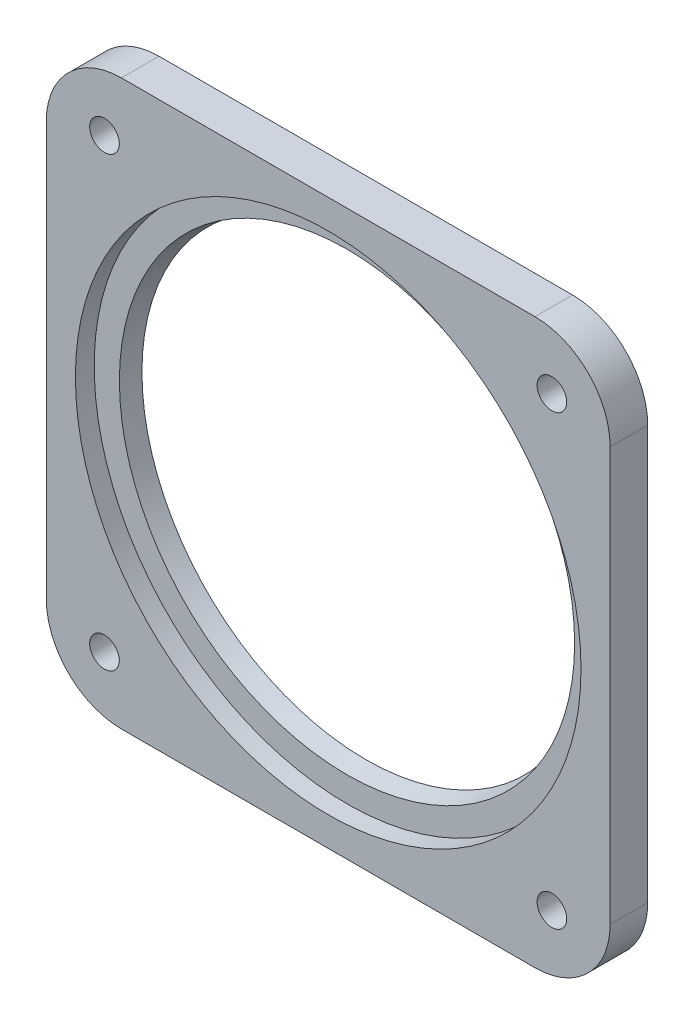
ISO-10303-21;
HEADER;
FILE_DESCRIPTION(('STEP AP214'),'2;1');
FILE_NAME('part.step','',(''),(''),'','','');
FILE_SCHEMA(('AUTOMOTIVE_DESIGN { 1 0 10303 214 1 1 1 1 }'));
ENDSEC;
DATA;
#1=APPLICATION_CONTEXT('core data for automotive mechanical design processes');
#2=APPLICATION_PROTOCOL_DEFINITION('international standard','automotive_design',2000,#1);
#3=PRODUCT_CONTEXT('',#1,'mechanical');
#4=PRODUCT('Part','Part','',(#3));
#5=PRODUCT_RELATED_PRODUCT_CATEGORY('part','',(#4));
#6=PRODUCT_DEFINITION_FORMATION('','',#4);
#7=PRODUCT_DEFINITION_CONTEXT('part definition',#1,'design');
#8=PRODUCT_DEFINITION('design','',#6,#7);
#9=PRODUCT_DEFINITION_SHAPE('','',#8);
#10=(LENGTH_UNIT() NAMED_UNIT(*) SI_UNIT(.MILLI.,.METRE.));
#11=(NAMED_UNIT(*) PLANE_ANGLE_UNIT() SI_UNIT($,.RADIAN.));
#12=(NAMED_UNIT(*) SI_UNIT($,.STERADIAN.) SOLID_ANGLE_UNIT());
#13=UNCERTAINTY_MEASURE_WITH_UNIT(LENGTH_MEASURE(1.E-05),#10,'distance_accuracy_value','');
#14=(GEOMETRIC_REPRESENTATION_CONTEXT(3) GLOBAL_UNCERTAINTY_ASSIGNED_CONTEXT((#13)) GLOBAL_UNIT_ASSIGNED_CONTEXT((#10,
#11,#12)) REPRESENTATION_CONTEXT('',''));
#15=CARTESIAN_POINT('',(0.,0.,0.));
#16=DIRECTION('',(0.,0.,1.));
#17=DIRECTION('',(1.,0.,0.));
#18=AXIS2_PLACEMENT_3D('',#15,#16,#17);
#19=CARTESIAN_POINT('',(-75.6285,0.,0.));
#20=DIRECTION('',(0.,0.,-1.));
#21=DIRECTION('',(-1.,0.,0.));
#22=AXIS2_PLACEMENT_3D('',#19,#20,#21);
#23=PLANE('',#22);
#24=CARTESIAN_POINT('',(0.,0.,0.));
#25=DIRECTION('',(0.,0.,-1.));
#26=DIRECTION('',(-1.,0.,0.));
#27=AXIS2_PLACEMENT_3D('',#24,#25,#26);
#28=CIRCLE('',#27,76.8985);
#29=CARTESIAN_POINT('',(-76.8985,0.,0.));
#30=VERTEX_POINT('',#29);
#31=EDGE_CURVE('E11',#30,#30,#28,.T.);
#32=ORIENTED_EDGE('',*,*,#31,.T.);
#33=EDGE_LOOP('',(#32));
#34=FACE_BOUND('',#33,.T.);
#35=CARTESIAN_POINT('',(0.,0.,0.));
#36=DIRECTION('',(0.,0.,-1.));
#37=DIRECTION('',(-1.,0.,0.));
#38=AXIS2_PLACEMENT_3D('',#35,#36,#37);
#39=CIRCLE('',#38,75.6285);
#40=CARTESIAN_POINT('',(-75.6285,0.,0.));
#41=VERTEX_POINT('',#40);
#42=EDGE_CURVE('E62',#41,#41,#39,.T.);
#43=ORIENTED_EDGE('',*,*,#42,.F.);
#44=EDGE_LOOP('',(#43));
#45=FACE_BOUND('',#44,.T.);
#46=ADVANCED_FACE('F52',(#34,#45),#23,.T.);
#47=CARTESIAN_POINT('',(0.,0.,-10.9982186410887));
#48=DIRECTION('',(0.,0.,-1.));
#49=DIRECTION('',(-1.,0.,0.));
#50=AXIS2_PLACEMENT_3D('',#47,#48,#49);
#51=CYLINDRICAL_SURFACE('',#50,76.8985);
#52=CARTESIAN_POINT('',(0.,0.,6.35000000000001));
#53=DIRECTION('',(0.,0.,-1.));
#54=DIRECTION('',(-1.,0.,0.));
#55=AXIS2_PLACEMENT_3D('',#52,#53,#54);
#56=CIRCLE('',#55,76.8985);
#57=CARTESIAN_POINT('',(-76.8985,0.,6.35000000000001));
#58=VERTEX_POINT('',#57);
#59=EDGE_CURVE('E58',#58,#58,#56,.T.);
#60=ORIENTED_EDGE('',*,*,#59,.T.);
#61=EDGE_LOOP('',(#60));
#62=FACE_BOUND('',#61,.T.);
#63=ORIENTED_EDGE('',*,*,#31,.F.);
#64=EDGE_LOOP('',(#63));
#65=FACE_BOUND('',#64,.T.);
#66=ADVANCED_FACE('F73',(#62,#65),#51,.T.);
#67=CARTESIAN_POINT('',(0.,0.,6.35000000000001));
#68=DIRECTION('',(0.,0.,1.));
#69=DIRECTION('',(1.,0.,0.));
#70=AXIS2_PLACEMENT_3D('',#67,#68,#69);
#71=CONICAL_SURFACE('',#70,76.8985,0.197395559849879);
#72=ORIENTED_EDGE('',*,*,#42,.T.);
#73=EDGE_LOOP('',(#72));
#74=FACE_BOUND('',#73,.T.);
#75=ORIENTED_EDGE('',*,*,#59,.F.);
#76=EDGE_LOOP('',(#75));
#77=FACE_BOUND('',#76,.T.);
#78=ADVANCED_FACE('F69',(#74,#77),#71,.F.);
#79=CLOSED_SHELL('',(#46,#66,#78));
#80=MANIFOLD_SOLID_BREP('B2',#79);
#81=CARTESIAN_POINT('',(0.,0.,12.7));
#82=DIRECTION('',(0.,0.,-1.));
#83=DIRECTION('',(-1.,0.,0.));
#84=AXIS2_PLACEMENT_3D('',#81,#82,#83);
#85=CYLINDRICAL_SURFACE('',#84,76.8985);
#86=CARTESIAN_POINT('',(0.,0.,0.));
#87=DIRECTION('',(0.,0.,1.));
#88=DIRECTION('',(1.,0.,0.));
#89=AXIS2_PLACEMENT_3D('',#86,#87,#88);
#90=CIRCLE('',#89,76.8985);
#91=CARTESIAN_POINT('',(76.8985,0.,0.));
#92=VERTEX_POINT('',#91);
#93=EDGE_CURVE('E214',#92,#92,#90,.T.);
#94=ORIENTED_EDGE('',*,*,#93,.F.);
#95=EDGE_LOOP('',(#94));
#96=FACE_BOUND('',#95,.T.);
#97=CARTESIAN_POINT('',(0.,0.,6.35));
#98=DIRECTION('',(0.,0.,1.));
#99=DIRECTION('',(1.,0.,0.));
#100=AXIS2_PLACEMENT_3D('',#97,#98,#99);
#101=CIRCLE('',#100,76.8985);
#102=CARTESIAN_POINT('',(76.8985,0.,6.35));
#103=VERTEX_POINT('',#102);
#104=EDGE_CURVE('E249',#103,#103,#101,.T.);
#105=ORIENTED_EDGE('',*,*,#104,.T.);
#106=EDGE_LOOP('',(#105));
#107=FACE_BOUND('',#106,.T.);
#108=ADVANCED_FACE('F105',(#96,#107),#85,.F.);
#109=CARTESIAN_POINT('',(-69.8499999999999,-69.8500000000001,12.7));
#110=DIRECTION('',(0.,0.,-1.));
#111=DIRECTION('',(-1.,0.,0.));
#112=AXIS2_PLACEMENT_3D('',#109,#110,#111);
#113=PLANE('',#112);
#114=CARTESIAN_POINT('',(75.5831095881406,75.5831095881405,12.7));
#115=DIRECTION('',(0.,0.,-1.));
#116=DIRECTION('',(-1.,0.,0.));
#117=AXIS2_PLACEMENT_3D('',#114,#115,#116);
#118=CIRCLE('',#117,5.);
#119=CARTESIAN_POINT('',(70.5831095881406,75.5831095881405,12.7));
#120=VERTEX_POINT('',#119);
#121=EDGE_CURVE('E631',#120,#120,#118,.T.);
#122=ORIENTED_EDGE('',*,*,#121,.T.);
#123=EDGE_LOOP('',(#122));
#124=FACE_BOUND('',#123,.T.);
#125=CARTESIAN_POINT('',(-75.5831095881406,75.5831095881405,12.7));
#126=DIRECTION('',(0.,0.,-1.));
#127=DIRECTION('',(-1.,0.,0.));
#128=AXIS2_PLACEMENT_3D('',#125,#126,#127);
#129=CIRCLE('',#128,5.);
#130=CARTESIAN_POINT('',(-80.5831095881406,75.5831095881405,12.7));
#131=VERTEX_POINT('',#130);
#132=EDGE_CURVE('E645',#131,#131,#129,.T.);
#133=ORIENTED_EDGE('',*,*,#132,.T.);
#134=EDGE_LOOP('',(#133));
#135=FACE_BOUND('',#134,.T.);
#136=CARTESIAN_POINT('',(75.5831095881406,-75.5831095881407,12.7));
#137=DIRECTION('',(0.,0.,-1.));
#138=DIRECTION('',(-1.,0.,0.));
#139=AXIS2_PLACEMENT_3D('',#136,#137,#138);
#140=CIRCLE('',#139,5.);
#141=CARTESIAN_POINT('',(70.5831095881406,-75.5831095881407,12.7));
#142=VERTEX_POINT('',#141);
#143=EDGE_CURVE('E347',#142,#142,#140,.T.);
#144=ORIENTED_EDGE('',*,*,#143,.T.);
#145=EDGE_LOOP('',(#144));
#146=FACE_BOUND('',#145,.T.);
#147=CARTESIAN_POINT('',(-75.5831095881405,-75.5831095881407,12.7));
#148=DIRECTION('',(0.,0.,-1.));
#149=DIRECTION('',(-1.,0.,0.));
#150=AXIS2_PLACEMENT_3D('',#147,#148,#149);
#151=CIRCLE('',#150,5.);
#152=CARTESIAN_POINT('',(-80.5831095881405,-75.5831095881407,12.7));
#153=VERTEX_POINT('',#152);
#154=EDGE_CURVE('E259',#153,#153,#151,.T.);
#155=ORIENTED_EDGE('',*,*,#154,.T.);
#156=EDGE_LOOP('',(#155));
#157=FACE_BOUND('',#156,.T.);
#158=CARTESIAN_POINT('',(0.,0.,12.7));
#159=DIRECTION('',(0.,0.,-1.));
#160=DIRECTION('',(-1.,0.,0.));
#161=AXIS2_PLACEMENT_3D('',#158,#159,#160);
#162=CIRCLE('',#161,85.4075);
#163=CARTESIAN_POINT('',(-85.4075,0.,12.7));
#164=VERTEX_POINT('',#163);
#165=EDGE_CURVE('E109',#164,#164,#162,.T.);
#166=ORIENTED_EDGE('',*,*,#165,.T.);
#167=EDGE_LOOP('',(#166));
#168=FACE_BOUND('',#167,.T.);
#169=CARTESIAN_POINT('',(-69.8499999999999,-69.8500000000001,12.7));
#170=DIRECTION('',(0.,0.,1.));
#171=DIRECTION('',(-1.,0.,0.));
#172=AXIS2_PLACEMENT_3D('',#169,#170,#171);
#173=CIRCLE('',#172,25.4);
#174=CARTESIAN_POINT('',(-95.2499999999999,-69.8500000000001,12.7));
#175=VERTEX_POINT('',#174);
#176=CARTESIAN_POINT('',(-69.8499999999999,-95.2500000000001,12.7));
#177=VERTEX_POINT('',#176);
#178=EDGE_CURVE('E232',#175,#177,#173,.T.);
#179=ORIENTED_EDGE('',*,*,#178,.T.);
#180=DIRECTION('',(1.,0.,0.));
#181=VECTOR('',#180,1.);
#182=CARTESIAN_POINT('',(69.8499999999999,-95.2500000000001,12.7));
#183=LINE('',#182,#181);
#184=CARTESIAN_POINT('',(69.8499999999999,-95.2500000000001,12.7));
#185=VERTEX_POINT('',#184);
#186=EDGE_CURVE('E168',#177,#185,#183,.T.);
#187=ORIENTED_EDGE('',*,*,#186,.T.);
#188=CARTESIAN_POINT('',(69.8499999999999,-69.8500000000001,12.7));
#189=DIRECTION('',(0.,0.,1.));
#190=DIRECTION('',(-1.,0.,0.));
#191=AXIS2_PLACEMENT_3D('',#188,#189,#190);
#192=CIRCLE('',#191,25.4000000000001);
#193=CARTESIAN_POINT('',(95.25,-69.8499999999999,12.7));
#194=VERTEX_POINT('',#193);
#195=EDGE_CURVE('E276',#185,#194,#192,.T.);
#196=ORIENTED_EDGE('',*,*,#195,.T.);
#197=DIRECTION('',(0.,1.,0.));
#198=VECTOR('',#197,1.);
#199=CARTESIAN_POINT('',(95.25,69.8499999999999,12.7));
#200=LINE('',#199,#198);
#201=CARTESIAN_POINT('',(95.25,69.8499999999999,12.7));
#202=VERTEX_POINT('',#201);
#203=EDGE_CURVE('E279',#194,#202,#200,.T.);
#204=ORIENTED_EDGE('',*,*,#203,.T.);
#205=CARTESIAN_POINT('',(69.85,69.8499999999999,12.7));
#206=DIRECTION('',(0.,0.,1.));
#207=DIRECTION('',(1.,0.,0.));
#208=AXIS2_PLACEMENT_3D('',#205,#206,#207);
#209=CIRCLE('',#208,25.4);
#210=CARTESIAN_POINT('',(69.85,95.2499999999999,12.7));
#211=VERTEX_POINT('',#210);
#212=EDGE_CURVE('E187',#202,#211,#209,.T.);
#213=ORIENTED_EDGE('',*,*,#212,.T.);
#214=DIRECTION('',(-1.,0.,0.));
#215=VECTOR('',#214,1.);
#216=CARTESIAN_POINT('',(-69.85,95.2499999999999,12.7));
#217=LINE('',#216,#215);
#218=CARTESIAN_POINT('',(-69.85,95.2499999999999,12.7));
#219=VERTEX_POINT('',#218);
#220=EDGE_CURVE('E181',#211,#219,#217,.T.);
#221=ORIENTED_EDGE('',*,*,#220,.T.);
#222=CARTESIAN_POINT('',(-69.85,69.8499999999999,12.7));
#223=DIRECTION('',(0.,0.,1.));
#224=DIRECTION('',(-1.,0.,0.));
#225=AXIS2_PLACEMENT_3D('',#222,#223,#224);
#226=CIRCLE('',#225,25.4);
#227=CARTESIAN_POINT('',(-95.25,69.8499999999999,12.7));
#228=VERTEX_POINT('',#227);
#229=EDGE_CURVE('E185',#219,#228,#226,.T.);
#230=ORIENTED_EDGE('',*,*,#229,.T.);
#231=DIRECTION('',(0.,-1.,0.));
#232=VECTOR('',#231,1.);
#233=CARTESIAN_POINT('',(-95.2499999999999,-69.8500000000001,12.7));
#234=LINE('',#233,#232);
#235=EDGE_CURVE('E125',#228,#175,#234,.T.);
#236=ORIENTED_EDGE('',*,*,#235,.T.);
#237=EDGE_LOOP('',(#179,#187,#196,#204,#213,#221,#230,#236));
#238=FACE_BOUND('',#237,.T.);
#239=ADVANCED_FACE('F183',(#124,#135,#146,#157,#168,#238),#113,.F.);
#240=CARTESIAN_POINT('',(-69.8499999999999,-69.8500000000001,0.));
#241=DIRECTION('',(0.,0.,-1.));
#242=DIRECTION('',(-1.,0.,0.));
#243=AXIS2_PLACEMENT_3D('',#240,#241,#242);
#244=PLANE('',#243);
#245=CARTESIAN_POINT('',(75.5831095881406,75.5831095881405,0.));
#246=DIRECTION('',(0.,0.,-1.));
#247=DIRECTION('',(-1.,0.,0.));
#248=AXIS2_PLACEMENT_3D('',#245,#246,#247);
#249=CIRCLE('',#248,9.0055);
#250=CARTESIAN_POINT('',(66.5776095881406,75.5831095881405,0.));
#251=VERTEX_POINT('',#250);
#252=EDGE_CURVE('E332',#251,#251,#249,.T.);
#253=ORIENTED_EDGE('',*,*,#252,.F.);
#254=EDGE_LOOP('',(#253));
#255=FACE_BOUND('',#254,.T.);
#256=CARTESIAN_POINT('',(-75.5831095881406,75.5831095881405,0.));
#257=DIRECTION('',(0.,0.,-1.));
#258=DIRECTION('',(-1.,0.,0.));
#259=AXIS2_PLACEMENT_3D('',#256,#257,#258);
#260=CIRCLE('',#259,9.0055);
#261=CARTESIAN_POINT('',(-84.5886095881406,75.5831095881405,0.));
#262=VERTEX_POINT('',#261);
#263=EDGE_CURVE('E336',#262,#262,#260,.T.);
#264=ORIENTED_EDGE('',*,*,#263,.F.);
#265=EDGE_LOOP('',(#264));
#266=FACE_BOUND('',#265,.T.);
#267=CARTESIAN_POINT('',(75.5831095881406,-75.5831095881407,0.));
#268=DIRECTION('',(0.,0.,-1.));
#269=DIRECTION('',(-1.,0.,0.));
#270=AXIS2_PLACEMENT_3D('',#267,#268,#269);
#271=CIRCLE('',#270,9.0055);
#272=CARTESIAN_POINT('',(66.5776095881406,-75.5831095881407,0.));
#273=VERTEX_POINT('',#272);
#274=EDGE_CURVE('E340',#273,#273,#271,.T.);
#275=ORIENTED_EDGE('',*,*,#274,.F.);
#276=EDGE_LOOP('',(#275));
#277=FACE_BOUND('',#276,.T.);
#278=CARTESIAN_POINT('',(-75.5831095881405,-75.5831095881407,0.));
#279=DIRECTION('',(0.,0.,-1.));
#280=DIRECTION('',(-1.,0.,0.));
#281=AXIS2_PLACEMENT_3D('',#278,#279,#280);
#282=CIRCLE('',#281,9.0055);
#283=CARTESIAN_POINT('',(-84.5886095881405,-75.5831095881407,0.));
#284=VERTEX_POINT('',#283);
#285=EDGE_CURVE('E343',#284,#284,#282,.T.);
#286=ORIENTED_EDGE('',*,*,#285,.F.);
#287=EDGE_LOOP('',(#286));
#288=FACE_BOUND('',#287,.T.);
#289=CARTESIAN_POINT('',(-69.8499999999999,-69.8500000000001,0.));
#290=DIRECTION('',(0.,0.,1.));
#291=DIRECTION('',(-1.,0.,0.));
#292=AXIS2_PLACEMENT_3D('',#289,#290,#291);
#293=CIRCLE('',#292,25.4);
#294=CARTESIAN_POINT('',(-95.2499999999999,-69.8500000000001,0.));
#295=VERTEX_POINT('',#294);
#296=CARTESIAN_POINT('',(-69.8499999999999,-95.2500000000001,0.));
#297=VERTEX_POINT('',#296);
#298=EDGE_CURVE('E209',#295,#297,#293,.T.);
#299=ORIENTED_EDGE('',*,*,#298,.F.);
#300=DIRECTION('',(0.,-1.,0.));
#301=VECTOR('',#300,1.);
#302=CARTESIAN_POINT('',(-95.2499999999999,-69.8500000000001,0.));
#303=LINE('',#302,#301);
#304=CARTESIAN_POINT('',(-95.25,69.8499999999999,0.));
#305=VERTEX_POINT('',#304);
#306=EDGE_CURVE('E160',#305,#295,#303,.T.);
#307=ORIENTED_EDGE('',*,*,#306,.F.);
#308=CARTESIAN_POINT('',(-69.85,69.8499999999999,0.));
#309=DIRECTION('',(0.,0.,1.));
#310=DIRECTION('',(-1.,0.,0.));
#311=AXIS2_PLACEMENT_3D('',#308,#309,#310);
#312=CIRCLE('',#311,25.4);
#313=CARTESIAN_POINT('',(-69.85,95.2499999999999,0.));
#314=VERTEX_POINT('',#313);
#315=EDGE_CURVE('E154',#314,#305,#312,.T.);
#316=ORIENTED_EDGE('',*,*,#315,.F.);
#317=DIRECTION('',(-1.,0.,0.));
#318=VECTOR('',#317,1.);
#319=CARTESIAN_POINT('',(-69.85,95.2499999999999,0.));
#320=LINE('',#319,#318);
#321=CARTESIAN_POINT('',(69.85,95.2499999999999,0.));
#322=VERTEX_POINT('',#321);
#323=EDGE_CURVE('E196',#322,#314,#320,.T.);
#324=ORIENTED_EDGE('',*,*,#323,.F.);
#325=CARTESIAN_POINT('',(69.85,69.8499999999999,0.));
#326=DIRECTION('',(0.,0.,1.));
#327=DIRECTION('',(1.,0.,0.));
#328=AXIS2_PLACEMENT_3D('',#325,#326,#327);
#329=CIRCLE('',#328,25.4);
#330=CARTESIAN_POINT('',(95.25,69.8499999999999,0.));
#331=VERTEX_POINT('',#330);
#332=EDGE_CURVE('E223',#331,#322,#329,.T.);
#333=ORIENTED_EDGE('',*,*,#332,.F.);
#334=DIRECTION('',(0.,1.,0.));
#335=VECTOR('',#334,1.);
#336=CARTESIAN_POINT('',(95.25,69.8499999999999,0.));
#337=LINE('',#336,#335);
#338=CARTESIAN_POINT('',(95.25,-69.8499999999999,0.));
#339=VERTEX_POINT('',#338);
#340=EDGE_CURVE('E220',#339,#331,#337,.T.);
#341=ORIENTED_EDGE('',*,*,#340,.F.);
#342=CARTESIAN_POINT('',(69.8499999999999,-69.8500000000001,0.));
#343=DIRECTION('',(0.,0.,1.));
#344=DIRECTION('',(-1.,0.,0.));
#345=AXIS2_PLACEMENT_3D('',#342,#343,#344);
#346=CIRCLE('',#345,25.4000000000001);
#347=CARTESIAN_POINT('',(69.8499999999999,-95.2500000000001,0.));
#348=VERTEX_POINT('',#347);
#349=EDGE_CURVE('E217',#348,#339,#346,.T.);
#350=ORIENTED_EDGE('',*,*,#349,.F.);
#351=DIRECTION('',(1.,0.,0.));
#352=VECTOR('',#351,1.);
#353=CARTESIAN_POINT('',(69.8499999999999,-95.2500000000001,0.));
#354=LINE('',#353,#352);
#355=EDGE_CURVE('E213',#297,#348,#354,.T.);
#356=ORIENTED_EDGE('',*,*,#355,.F.);
#357=EDGE_LOOP('',(#299,#307,#316,#324,#333,#341,#350,#356));
#358=FACE_BOUND('',#357,.T.);
#359=ORIENTED_EDGE('',*,*,#93,.T.);
#360=EDGE_LOOP('',(#359));
#361=FACE_BOUND('',#360,.T.);
#362=ADVANCED_FACE('F294',(#255,#266,#277,#288,#358,#361),#244,.T.);
#363=CARTESIAN_POINT('',(-69.8499999999999,-69.8500000000001,12.7));
#364=DIRECTION('',(0.,0.,-1.));
#365=DIRECTION('',(-1.,0.,0.));
#366=AXIS2_PLACEMENT_3D('',#363,#364,#365);
#367=CYLINDRICAL_SURFACE('',#366,25.4);
#368=ORIENTED_EDGE('',*,*,#298,.T.);
#369=DIRECTION('',(0.,0.,-1.));
#370=VECTOR('',#369,1.);
#371=CARTESIAN_POINT('',(-69.8499999999999,-95.2500000000001,12.7));
#372=LINE('',#371,#370);
#373=EDGE_CURVE('E50',#177,#297,#372,.T.);
#374=ORIENTED_EDGE('',*,*,#373,.F.);
#375=ORIENTED_EDGE('',*,*,#178,.F.);
#376=DIRECTION('',(0.,0.,-1.));
#377=VECTOR('',#376,1.);
#378=CARTESIAN_POINT('',(-95.2499999999999,-69.8500000000001,12.7));
#379=LINE('',#378,#377);
#380=EDGE_CURVE('E205',#175,#295,#379,.T.);
#381=ORIENTED_EDGE('',*,*,#380,.T.);
#382=EDGE_LOOP('',(#368,#374,#375,#381));
#383=FACE_BOUND('',#382,.T.);
#384=ADVANCED_FACE('F107',(#383),#367,.T.);
#385=CARTESIAN_POINT('',(69.8499999999999,-95.2500000000001,12.7));
#386=DIRECTION('',(0.,1.,0.));
#387=DIRECTION('',(0.,0.,1.));
#388=AXIS2_PLACEMENT_3D('',#385,#386,#387);
#389=PLANE('',#388);
#390=ORIENTED_EDGE('',*,*,#355,.T.);
#391=DIRECTION('',(0.,0.,-1.));
#392=VECTOR('',#391,1.);
#393=CARTESIAN_POINT('',(69.8499999999999,-95.2500000000001,12.7));
#394=LINE('',#393,#392);
#395=EDGE_CURVE('E116',#185,#348,#394,.T.);
#396=ORIENTED_EDGE('',*,*,#395,.F.);
#397=ORIENTED_EDGE('',*,*,#186,.F.);
#398=ORIENTED_EDGE('',*,*,#373,.T.);
#399=EDGE_LOOP('',(#390,#396,#397,#398));
#400=FACE_BOUND('',#399,.T.);
#401=ADVANCED_FACE('F328',(#400),#389,.F.);
#402=CARTESIAN_POINT('',(69.8499999999999,-69.8500000000001,12.7));
#403=DIRECTION('',(0.,0.,-1.));
#404=DIRECTION('',(-1.,0.,0.));
#405=AXIS2_PLACEMENT_3D('',#402,#403,#404);
#406=CYLINDRICAL_SURFACE('',#405,25.4000000000001);
#407=ORIENTED_EDGE('',*,*,#349,.T.);
#408=DIRECTION('',(0.,0.,-1.));
#409=VECTOR('',#408,1.);
#410=CARTESIAN_POINT('',(95.25,-69.8499999999999,12.7));
#411=LINE('',#410,#409);
#412=EDGE_CURVE('E243',#194,#339,#411,.T.);
#413=ORIENTED_EDGE('',*,*,#412,.F.);
#414=ORIENTED_EDGE('',*,*,#195,.F.);
#415=ORIENTED_EDGE('',*,*,#395,.T.);
#416=EDGE_LOOP('',(#407,#413,#414,#415));
#417=FACE_BOUND('',#416,.T.);
#418=ADVANCED_FACE('F563',(#417),#406,.T.);
#419=CARTESIAN_POINT('',(95.25,69.8499999999999,12.7));
#420=DIRECTION('',(-1.,0.,0.));
#421=DIRECTION('',(0.,-1.,0.));
#422=AXIS2_PLACEMENT_3D('',#419,#420,#421);
#423=PLANE('',#422);
#424=ORIENTED_EDGE('',*,*,#340,.T.);
#425=DIRECTION('',(0.,0.,-1.));
#426=VECTOR('',#425,1.);
#427=CARTESIAN_POINT('',(95.25,69.8499999999999,12.7));
#428=LINE('',#427,#426);
#429=EDGE_CURVE('E239',#202,#331,#428,.T.);
#430=ORIENTED_EDGE('',*,*,#429,.F.);
#431=ORIENTED_EDGE('',*,*,#203,.F.);
#432=ORIENTED_EDGE('',*,*,#412,.T.);
#433=EDGE_LOOP('',(#424,#430,#431,#432));
#434=FACE_BOUND('',#433,.T.);
#435=ADVANCED_FACE('F287',(#434),#423,.F.);
#436=CARTESIAN_POINT('',(69.85,69.8499999999999,12.7));
#437=DIRECTION('',(0.,0.,-1.));
#438=DIRECTION('',(-1.,0.,0.));
#439=AXIS2_PLACEMENT_3D('',#436,#437,#438);
#440=CYLINDRICAL_SURFACE('',#439,25.4);
#441=ORIENTED_EDGE('',*,*,#332,.T.);
#442=DIRECTION('',(0.,0.,-1.));
#443=VECTOR('',#442,1.);
#444=CARTESIAN_POINT('',(69.85,95.2499999999999,12.7));
#445=LINE('',#444,#443);
#446=EDGE_CURVE('E198',#211,#322,#445,.T.);
#447=ORIENTED_EDGE('',*,*,#446,.F.);
#448=ORIENTED_EDGE('',*,*,#212,.F.);
#449=ORIENTED_EDGE('',*,*,#429,.T.);
#450=EDGE_LOOP('',(#441,#447,#448,#449));
#451=FACE_BOUND('',#450,.T.);
#452=ADVANCED_FACE('F291',(#451),#440,.T.);
#453=CARTESIAN_POINT('',(-69.85,95.2499999999999,12.7));
#454=DIRECTION('',(0.,-1.,0.));
#455=DIRECTION('',(0.,0.,-1.));
#456=AXIS2_PLACEMENT_3D('',#453,#454,#455);
#457=PLANE('',#456);
#458=ORIENTED_EDGE('',*,*,#323,.T.);
#459=DIRECTION('',(0.,0.,-1.));
#460=VECTOR('',#459,1.);
#461=CARTESIAN_POINT('',(-69.85,95.2499999999999,12.7));
#462=LINE('',#461,#460);
#463=EDGE_CURVE('E193',#219,#314,#462,.T.);
#464=ORIENTED_EDGE('',*,*,#463,.F.);
#465=ORIENTED_EDGE('',*,*,#220,.F.);
#466=ORIENTED_EDGE('',*,*,#446,.T.);
#467=EDGE_LOOP('',(#458,#464,#465,#466));
#468=FACE_BOUND('',#467,.T.);
#469=ADVANCED_FACE('F194',(#468),#457,.F.);
#470=CARTESIAN_POINT('',(-69.85,69.8499999999999,12.7));
#471=DIRECTION('',(0.,0.,-1.));
#472=DIRECTION('',(-1.,0.,0.));
#473=AXIS2_PLACEMENT_3D('',#470,#471,#472);
#474=CYLINDRICAL_SURFACE('',#473,25.4);
#475=ORIENTED_EDGE('',*,*,#315,.T.);
#476=DIRECTION('',(0.,0.,-1.));
#477=VECTOR('',#476,1.);
#478=CARTESIAN_POINT('',(-95.25,69.8499999999999,12.7));
#479=LINE('',#478,#477);
#480=EDGE_CURVE('E199',#228,#305,#479,.T.);
#481=ORIENTED_EDGE('',*,*,#480,.F.);
#482=ORIENTED_EDGE('',*,*,#229,.F.);
#483=ORIENTED_EDGE('',*,*,#463,.T.);
#484=EDGE_LOOP('',(#475,#481,#482,#483));
#485=FACE_BOUND('',#484,.T.);
#486=ADVANCED_FACE('F201',(#485),#474,.T.);
#487=CARTESIAN_POINT('',(-95.2499999999999,-69.8500000000001,12.7));
#488=DIRECTION('',(1.,0.,0.));
#489=DIRECTION('',(0.,1.,0.));
#490=AXIS2_PLACEMENT_3D('',#487,#488,#489);
#491=PLANE('',#490);
#492=ORIENTED_EDGE('',*,*,#306,.T.);
#493=ORIENTED_EDGE('',*,*,#380,.F.);
#494=ORIENTED_EDGE('',*,*,#235,.F.);
#495=ORIENTED_EDGE('',*,*,#480,.T.);
#496=EDGE_LOOP('',(#492,#493,#494,#495));
#497=FACE_BOUND('',#496,.T.);
#498=ADVANCED_FACE('F300',(#497),#491,.F.);
#499=CARTESIAN_POINT('',(0.,0.,6.35));
#500=DIRECTION('',(0.,0.,1.));
#501=DIRECTION('',(1.,0.,0.));
#502=AXIS2_PLACEMENT_3D('',#499,#500,#501);
#503=CYLINDRICAL_SURFACE('',#502,85.4075);
#504=CARTESIAN_POINT('',(0.,0.,6.35));
#505=DIRECTION('',(0.,0.,1.));
#506=DIRECTION('',(1.,0.,0.));
#507=AXIS2_PLACEMENT_3D('',#504,#505,#506);
#508=CIRCLE('',#507,85.4075);
#509=CARTESIAN_POINT('',(85.4075,0.,6.35));
#510=VERTEX_POINT('',#509);
#511=EDGE_CURVE('E252',#510,#510,#508,.T.);
#512=ORIENTED_EDGE('',*,*,#511,.F.);
#513=EDGE_LOOP('',(#512));
#514=FACE_BOUND('',#513,.T.);
#515=ORIENTED_EDGE('',*,*,#165,.F.);
#516=EDGE_LOOP('',(#515));
#517=FACE_BOUND('',#516,.T.);
#518=ADVANCED_FACE('F302',(#514,#517),#503,.F.);
#519=CARTESIAN_POINT('',(0.,0.,6.35));
#520=DIRECTION('',(0.,0.,1.));
#521=DIRECTION('',(1.,0.,0.));
#522=AXIS2_PLACEMENT_3D('',#519,#520,#521);
#523=PLANE('',#522);
#524=ORIENTED_EDGE('',*,*,#104,.F.);
#525=EDGE_LOOP('',(#524));
#526=FACE_BOUND('',#525,.T.);
#527=ORIENTED_EDGE('',*,*,#511,.T.);
#528=EDGE_LOOP('',(#527));
#529=FACE_BOUND('',#528,.T.);
#530=ADVANCED_FACE('F308',(#526,#529),#523,.T.);
#531=CARTESIAN_POINT('',(-75.5831095881405,-75.5831095881407,0.));
#532=DIRECTION('',(0.,0.,-1.));
#533=DIRECTION('',(-1.,0.,0.));
#534=AXIS2_PLACEMENT_3D('',#531,#532,#533);
#535=CYLINDRICAL_SURFACE('',#534,5.);
#536=ORIENTED_EDGE('',*,*,#154,.F.);
#537=EDGE_LOOP('',(#536));
#538=FACE_BOUND('',#537,.T.);
#539=CARTESIAN_POINT('',(-75.5831095881405,-75.5831095881407,5.3));
#540=DIRECTION('',(0.,0.,-1.));
#541=DIRECTION('',(-1.,0.,0.));
#542=AXIS2_PLACEMENT_3D('',#539,#540,#541);
#543=CIRCLE('',#542,5.);
#544=CARTESIAN_POINT('',(-80.5831095881405,-75.5831095881407,5.3));
#545=VERTEX_POINT('',#544);
#546=EDGE_CURVE('E265',#545,#545,#543,.T.);
#547=ORIENTED_EDGE('',*,*,#546,.T.);
#548=EDGE_LOOP('',(#547));
#549=FACE_BOUND('',#548,.T.);
#550=ADVANCED_FACE('F361',(#538,#549),#535,.F.);
#551=CARTESIAN_POINT('',(-70.5831095881405,-75.5831095881407,5.3));
#552=DIRECTION('',(0.,0.,1.));
#553=DIRECTION('',(1.,0.,0.));
#554=AXIS2_PLACEMENT_3D('',#551,#552,#553);
#555=PLANE('',#554);
#556=ORIENTED_EDGE('',*,*,#546,.F.);
#557=EDGE_LOOP('',(#556));
#558=FACE_BOUND('',#557,.T.);
#559=CARTESIAN_POINT('',(-75.5831095881405,-75.5831095881407,5.3));
#560=DIRECTION('',(0.,0.,-1.));
#561=DIRECTION('',(-1.,0.,0.));
#562=AXIS2_PLACEMENT_3D('',#559,#560,#561);
#563=CIRCLE('',#562,9.0055);
#564=CARTESIAN_POINT('',(-84.5886095881405,-75.5831095881407,5.3));
#565=VERTEX_POINT('',#564);
#566=EDGE_CURVE('E346',#565,#565,#563,.T.);
#567=ORIENTED_EDGE('',*,*,#566,.T.);
#568=EDGE_LOOP('',(#567));
#569=FACE_BOUND('',#568,.T.);
#570=ADVANCED_FACE('F363',(#558,#569),#555,.F.);
#571=CARTESIAN_POINT('',(-75.5831095881405,-75.5831095881407,0.));
#572=DIRECTION('',(0.,0.,-1.));
#573=DIRECTION('',(-1.,0.,0.));
#574=AXIS2_PLACEMENT_3D('',#571,#572,#573);
#575=CYLINDRICAL_SURFACE('',#574,9.0055);
#576=ORIENTED_EDGE('',*,*,#566,.F.);
#577=EDGE_LOOP('',(#576));
#578=FACE_BOUND('',#577,.T.);
#579=ORIENTED_EDGE('',*,*,#285,.T.);
#580=EDGE_LOOP('',(#579));
#581=FACE_BOUND('',#580,.T.);
#582=ADVANCED_FACE('F366',(#578,#581),#575,.F.);
#583=CARTESIAN_POINT('',(75.5831095881406,-75.5831095881407,0.));
#584=DIRECTION('',(0.,0.,-1.));
#585=DIRECTION('',(-1.,0.,0.));
#586=AXIS2_PLACEMENT_3D('',#583,#584,#585);
#587=CYLINDRICAL_SURFACE('',#586,5.);
#588=ORIENTED_EDGE('',*,*,#143,.F.);
#589=EDGE_LOOP('',(#588));
#590=FACE_BOUND('',#589,.T.);
#591=CARTESIAN_POINT('',(75.5831095881406,-75.5831095881407,5.3));
#592=DIRECTION('',(0.,0.,-1.));
#593=DIRECTION('',(-1.,0.,0.));
#594=AXIS2_PLACEMENT_3D('',#591,#592,#593);
#595=CIRCLE('',#594,5.);
#596=CARTESIAN_POINT('',(70.5831095881406,-75.5831095881407,5.3));
#597=VERTEX_POINT('',#596);
#598=EDGE_CURVE('E354',#597,#597,#595,.T.);
#599=ORIENTED_EDGE('',*,*,#598,.T.);
#600=EDGE_LOOP('',(#599));
#601=FACE_BOUND('',#600,.T.);
#602=ADVANCED_FACE('F371',(#590,#601),#587,.F.);
#603=CARTESIAN_POINT('',(80.5831095881406,-75.5831095881407,5.3));
#604=DIRECTION('',(0.,0.,1.));
#605=DIRECTION('',(1.,0.,0.));
#606=AXIS2_PLACEMENT_3D('',#603,#604,#605);
#607=PLANE('',#606);
#608=ORIENTED_EDGE('',*,*,#598,.F.);
#609=EDGE_LOOP('',(#608));
#610=FACE_BOUND('',#609,.T.);
#611=CARTESIAN_POINT('',(75.5831095881406,-75.5831095881407,5.3));
#612=DIRECTION('',(0.,0.,-1.));
#613=DIRECTION('',(-1.,0.,0.));
#614=AXIS2_PLACEMENT_3D('',#611,#612,#613);
#615=CIRCLE('',#614,9.0055);
#616=CARTESIAN_POINT('',(66.5776095881406,-75.5831095881407,5.3));
#617=VERTEX_POINT('',#616);
#618=EDGE_CURVE('E651',#617,#617,#615,.T.);
#619=ORIENTED_EDGE('',*,*,#618,.T.);
#620=EDGE_LOOP('',(#619));
#621=FACE_BOUND('',#620,.T.);
#622=ADVANCED_FACE('F376',(#610,#621),#607,.F.);
#623=CARTESIAN_POINT('',(75.5831095881406,-75.5831095881407,0.));
#624=DIRECTION('',(0.,0.,-1.));
#625=DIRECTION('',(-1.,0.,0.));
#626=AXIS2_PLACEMENT_3D('',#623,#624,#625);
#627=CYLINDRICAL_SURFACE('',#626,9.0055);
#628=ORIENTED_EDGE('',*,*,#618,.F.);
#629=EDGE_LOOP('',(#628));
#630=FACE_BOUND('',#629,.T.);
#631=ORIENTED_EDGE('',*,*,#274,.T.);
#632=EDGE_LOOP('',(#631));
#633=FACE_BOUND('',#632,.T.);
#634=ADVANCED_FACE('F420',(#630,#633),#627,.F.);
#635=CARTESIAN_POINT('',(-75.5831095881406,75.5831095881405,0.));
#636=DIRECTION('',(0.,0.,-1.));
#637=DIRECTION('',(-1.,0.,0.));
#638=AXIS2_PLACEMENT_3D('',#635,#636,#637);
#639=CYLINDRICAL_SURFACE('',#638,5.);
#640=ORIENTED_EDGE('',*,*,#132,.F.);
#641=EDGE_LOOP('',(#640));
#642=FACE_BOUND('',#641,.T.);
#643=CARTESIAN_POINT('',(-75.5831095881406,75.5831095881405,5.3));
#644=DIRECTION('',(0.,0.,-1.));
#645=DIRECTION('',(-1.,0.,0.));
#646=AXIS2_PLACEMENT_3D('',#643,#644,#645);
#647=CIRCLE('',#646,5.);
#648=CARTESIAN_POINT('',(-80.5831095881406,75.5831095881405,5.3));
#649=VERTEX_POINT('',#648);
#650=EDGE_CURVE('E641',#649,#649,#647,.T.);
#651=ORIENTED_EDGE('',*,*,#650,.T.);
#652=EDGE_LOOP('',(#651));
#653=FACE_BOUND('',#652,.T.);
#654=ADVANCED_FACE('F430',(#642,#653),#639,.F.);
#655=CARTESIAN_POINT('',(-70.5831095881406,75.5831095881405,5.3));
#656=DIRECTION('',(0.,0.,1.));
#657=DIRECTION('',(1.,0.,0.));
#658=AXIS2_PLACEMENT_3D('',#655,#656,#657);
#659=PLANE('',#658);
#660=ORIENTED_EDGE('',*,*,#650,.F.);
#661=EDGE_LOOP('',(#660));
#662=FACE_BOUND('',#661,.T.);
#663=CARTESIAN_POINT('',(-75.5831095881406,75.5831095881405,5.3));
#664=DIRECTION('',(0.,0.,-1.));
#665=DIRECTION('',(-1.,0.,0.));
#666=AXIS2_PLACEMENT_3D('',#663,#664,#665);
#667=CIRCLE('',#666,9.0055);
#668=CARTESIAN_POINT('',(-84.5886095881406,75.5831095881405,5.3));
#669=VERTEX_POINT('',#668);
#670=EDGE_CURVE('E637',#669,#669,#667,.T.);
#671=ORIENTED_EDGE('',*,*,#670,.T.);
#672=EDGE_LOOP('',(#671));
#673=FACE_BOUND('',#672,.T.);
#674=ADVANCED_FACE('F441',(#662,#673),#659,.F.);
#675=CARTESIAN_POINT('',(-75.5831095881406,75.5831095881405,0.));
#676=DIRECTION('',(0.,0.,-1.));
#677=DIRECTION('',(-1.,0.,0.));
#678=AXIS2_PLACEMENT_3D('',#675,#676,#677);
#679=CYLINDRICAL_SURFACE('',#678,9.0055);
#680=ORIENTED_EDGE('',*,*,#670,.F.);
#681=EDGE_LOOP('',(#680));
#682=FACE_BOUND('',#681,.T.);
#683=ORIENTED_EDGE('',*,*,#263,.T.);
#684=EDGE_LOOP('',(#683));
#685=FACE_BOUND('',#684,.T.);
#686=ADVANCED_FACE('F452',(#682,#685),#679,.F.);
#687=CARTESIAN_POINT('',(75.5831095881406,75.5831095881405,0.));
#688=DIRECTION('',(0.,0.,-1.));
#689=DIRECTION('',(-1.,0.,0.));
#690=AXIS2_PLACEMENT_3D('',#687,#688,#689);
#691=CYLINDRICAL_SURFACE('',#690,5.);
#692=ORIENTED_EDGE('',*,*,#121,.F.);
#693=EDGE_LOOP('',(#692));
#694=FACE_BOUND('',#693,.T.);
#695=CARTESIAN_POINT('',(75.5831095881406,75.5831095881405,5.3));
#696=DIRECTION('',(0.,0.,-1.));
#697=DIRECTION('',(-1.,0.,0.));
#698=AXIS2_PLACEMENT_3D('',#695,#696,#697);
#699=CIRCLE('',#698,5.);
#700=CARTESIAN_POINT('',(70.5831095881406,75.5831095881405,5.3));
#701=VERTEX_POINT('',#700);
#702=EDGE_CURVE('E625',#701,#701,#699,.T.);
#703=ORIENTED_EDGE('',*,*,#702,.T.);
#704=EDGE_LOOP('',(#703));
#705=FACE_BOUND('',#704,.T.);
#706=ADVANCED_FACE('F463',(#694,#705),#691,.F.);
#707=CARTESIAN_POINT('',(80.5831095881406,75.5831095881405,5.3));
#708=DIRECTION('',(0.,0.,1.));
#709=DIRECTION('',(1.,0.,0.));
#710=AXIS2_PLACEMENT_3D('',#707,#708,#709);
#711=PLANE('',#710);
#712=ORIENTED_EDGE('',*,*,#702,.F.);
#713=EDGE_LOOP('',(#712));
#714=FACE_BOUND('',#713,.T.);
#715=CARTESIAN_POINT('',(75.5831095881406,75.5831095881405,5.3));
#716=DIRECTION('',(0.,0.,-1.));
#717=DIRECTION('',(-1.,0.,0.));
#718=AXIS2_PLACEMENT_3D('',#715,#716,#717);
#719=CIRCLE('',#718,9.0055);
#720=CARTESIAN_POINT('',(66.5776095881406,75.5831095881405,5.3));
#721=VERTEX_POINT('',#720);
#722=EDGE_CURVE('E621',#721,#721,#719,.T.);
#723=ORIENTED_EDGE('',*,*,#722,.T.);
#724=EDGE_LOOP('',(#723));
#725=FACE_BOUND('',#724,.T.);
#726=ADVANCED_FACE('F474',(#714,#725),#711,.F.);
#727=CARTESIAN_POINT('',(75.5831095881406,75.5831095881405,0.));
#728=DIRECTION('',(0.,0.,-1.));
#729=DIRECTION('',(-1.,0.,0.));
#730=AXIS2_PLACEMENT_3D('',#727,#728,#729);
#731=CYLINDRICAL_SURFACE('',#730,9.0055);
#732=ORIENTED_EDGE('',*,*,#722,.F.);
#733=EDGE_LOOP('',(#732));
#734=FACE_BOUND('',#733,.T.);
#735=ORIENTED_EDGE('',*,*,#252,.T.);
#736=EDGE_LOOP('',(#735));
#737=FACE_BOUND('',#736,.T.);
#738=ADVANCED_FACE('F485',(#734,#737),#731,.F.);
#739=CLOSED_SHELL('',(#108,#239,#362,#384,#401,#418,#435,#452,#469,#486,#498,#518,#530,#550,
#570,#582,#602,#622,#634,#654,#674,#686,#706,#726,#738));
#740=MANIFOLD_SOLID_BREP('B6',#739);
#741=ADVANCED_BREP_SHAPE_REPRESENTATION('',(#18,#80,#740),#14);
#742=SHAPE_DEFINITION_REPRESENTATION(#9,#741);
ENDSEC;
END-ISO-10303-21;
